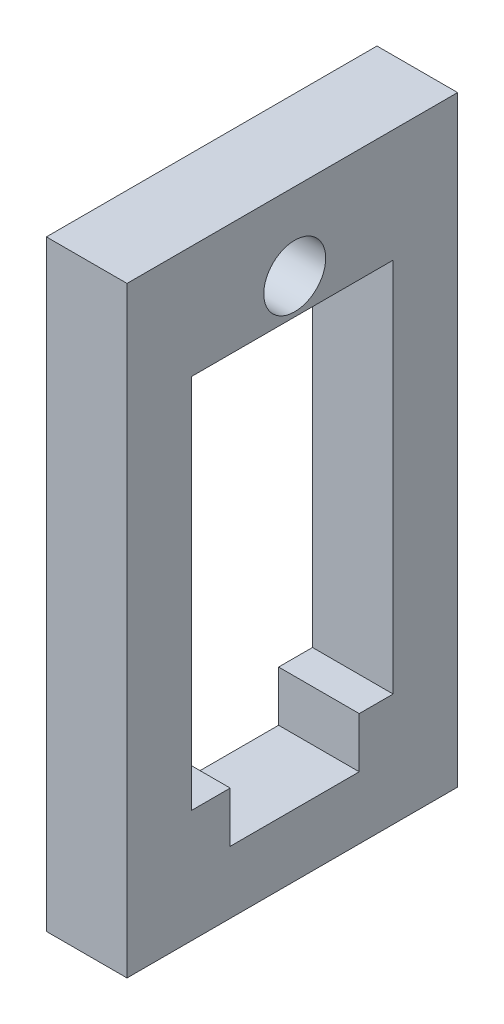
ISO-10303-21;
HEADER;
FILE_DESCRIPTION(('STEP AP214'),'2;1');
FILE_NAME('part.step','',(''),(''),'','','');
FILE_SCHEMA(('AUTOMOTIVE_DESIGN { 1 0 10303 214 1 1 1 1 }'));
ENDSEC;
DATA;
#1=APPLICATION_CONTEXT('core data for automotive mechanical design processes');
#2=APPLICATION_PROTOCOL_DEFINITION('international standard','automotive_design',2000,#1);
#3=PRODUCT_CONTEXT('',#1,'mechanical');
#4=PRODUCT('Part','Part','',(#3));
#5=PRODUCT_RELATED_PRODUCT_CATEGORY('part','',(#4));
#6=PRODUCT_DEFINITION_FORMATION('','',#4);
#7=PRODUCT_DEFINITION_CONTEXT('part definition',#1,'design');
#8=PRODUCT_DEFINITION('design','',#6,#7);
#9=PRODUCT_DEFINITION_SHAPE('','',#8);
#10=(LENGTH_UNIT() NAMED_UNIT(*) SI_UNIT(.MILLI.,.METRE.));
#11=(NAMED_UNIT(*) PLANE_ANGLE_UNIT() SI_UNIT($,.RADIAN.));
#12=(NAMED_UNIT(*) SI_UNIT($,.STERADIAN.) SOLID_ANGLE_UNIT());
#13=UNCERTAINTY_MEASURE_WITH_UNIT(LENGTH_MEASURE(1.E-05),#10,'distance_accuracy_value','');
#14=(GEOMETRIC_REPRESENTATION_CONTEXT(3) GLOBAL_UNCERTAINTY_ASSIGNED_CONTEXT((#13)) GLOBAL_UNIT_ASSIGNED_CONTEXT((#10,
#11,#12)) REPRESENTATION_CONTEXT('',''));
#15=CARTESIAN_POINT('',(0.,0.,0.));
#16=DIRECTION('',(0.,0.,1.));
#17=DIRECTION('',(1.,0.,0.));
#18=AXIS2_PLACEMENT_3D('',#15,#16,#17);
#19=CARTESIAN_POINT('',(5.,-12.05,6.4));
#20=DIRECTION('',(0.,1.,0.));
#21=DIRECTION('',(0.,0.,1.));
#22=AXIS2_PLACEMENT_3D('',#19,#20,#21);
#23=PLANE('',#22);
#24=DIRECTION('',(1.,0.,0.));
#25=VECTOR('',#24,1.);
#26=CARTESIAN_POINT('',(5.,-12.05,4.));
#27=LINE('',#26,#25);
#28=CARTESIAN_POINT('',(0.,-12.05,4.));
#29=VERTEX_POINT('',#28);
#30=CARTESIAN_POINT('',(5.,-12.05,4.));
#31=VERTEX_POINT('',#30);
#32=EDGE_CURVE('E44',#29,#31,#27,.T.);
#33=ORIENTED_EDGE('',*,*,#32,.F.);
#34=DIRECTION('',(0.,0.,-1.));
#35=VECTOR('',#34,1.);
#36=CARTESIAN_POINT('',(0.,-12.05,6.4));
#37=LINE('',#36,#35);
#38=CARTESIAN_POINT('',(0.,-12.05,6.4));
#39=VERTEX_POINT('',#38);
#40=EDGE_CURVE('E160',#39,#29,#37,.T.);
#41=ORIENTED_EDGE('',*,*,#40,.F.);
#42=DIRECTION('',(-1.,0.,0.));
#43=VECTOR('',#42,1.);
#44=CARTESIAN_POINT('',(5.,-12.05,6.4));
#45=LINE('',#44,#43);
#46=CARTESIAN_POINT('',(5.,-12.05,6.4));
#47=VERTEX_POINT('',#46);
#48=EDGE_CURVE('E59',#47,#39,#45,.T.);
#49=ORIENTED_EDGE('',*,*,#48,.F.);
#50=DIRECTION('',(0.,0.,-1.));
#51=VECTOR('',#50,1.);
#52=CARTESIAN_POINT('',(5.,-12.05,6.4));
#53=LINE('',#52,#51);
#54=EDGE_CURVE('E165',#47,#31,#53,.T.);
#55=ORIENTED_EDGE('',*,*,#54,.T.);
#56=EDGE_LOOP('',(#33,#41,#49,#55));
#57=FACE_BOUND('',#56,.T.);
#58=ADVANCED_FACE('F36',(#57),#23,.T.);
#59=CARTESIAN_POINT('',(5.,0.,0.));
#60=DIRECTION('',(-1.,0.,0.));
#61=DIRECTION('',(0.,0.,1.));
#62=AXIS2_PLACEMENT_3D('',#59,#60,#61);
#63=PLANE('',#62);
#64=CARTESIAN_POINT('',(5.,13.45,0.));
#65=DIRECTION('',(1.,0.,0.));
#66=DIRECTION('',(0.,0.,-1.));
#67=AXIS2_PLACEMENT_3D('',#64,#65,#66);
#68=CIRCLE('',#67,1.92);
#69=CARTESIAN_POINT('',(5.,13.45,-1.92));
#70=VERTEX_POINT('',#69);
#71=EDGE_CURVE('E153',#70,#70,#68,.T.);
#72=ORIENTED_EDGE('',*,*,#71,.F.);
#73=EDGE_LOOP('',(#72));
#74=FACE_BOUND('',#73,.T.);
#75=DIRECTION('',(0.,1.,0.));
#76=VECTOR('',#75,1.);
#77=CARTESIAN_POINT('',(5.,-19.05,-10.1));
#78=LINE('',#77,#76);
#79=CARTESIAN_POINT('',(5.,-19.05,-10.1));
#80=VERTEX_POINT('',#79);
#81=CARTESIAN_POINT('',(5.,18.25,-10.1));
#82=VERTEX_POINT('',#81);
#83=EDGE_CURVE('E189',#80,#82,#78,.T.);
#84=ORIENTED_EDGE('',*,*,#83,.T.);
#85=DIRECTION('',(0.,0.,1.));
#86=VECTOR('',#85,1.);
#87=CARTESIAN_POINT('',(5.,18.25,10.4));
#88=LINE('',#87,#86);
#89=CARTESIAN_POINT('',(5.,18.25,10.4));
#90=VERTEX_POINT('',#89);
#91=EDGE_CURVE('E192',#82,#90,#88,.T.);
#92=ORIENTED_EDGE('',*,*,#91,.T.);
#93=DIRECTION('',(0.,-1.,0.));
#94=VECTOR('',#93,1.);
#95=CARTESIAN_POINT('',(5.,-19.05,10.4));
#96=LINE('',#95,#94);
#97=CARTESIAN_POINT('',(5.,-19.05,10.4));
#98=VERTEX_POINT('',#97);
#99=EDGE_CURVE('E195',#90,#98,#96,.T.);
#100=ORIENTED_EDGE('',*,*,#99,.T.);
#101=DIRECTION('',(0.,0.,-1.));
#102=VECTOR('',#101,1.);
#103=CARTESIAN_POINT('',(5.,-19.05,10.4));
#104=LINE('',#103,#102);
#105=EDGE_CURVE('E197',#98,#80,#104,.T.);
#106=ORIENTED_EDGE('',*,*,#105,.T.);
#107=EDGE_LOOP('',(#84,#92,#100,#106));
#108=FACE_BOUND('',#107,.T.);
#109=DIRECTION('',(0.,0.,-1.));
#110=VECTOR('',#109,1.);
#111=CARTESIAN_POINT('',(5.,-15.1767991263553,4.));
#112=LINE('',#111,#110);
#113=CARTESIAN_POINT('',(5.,-15.1767991263553,4.));
#114=VERTEX_POINT('',#113);
#115=CARTESIAN_POINT('',(5.,-15.1767991263553,-4.));
#116=VERTEX_POINT('',#115);
#117=EDGE_CURVE('E130',#114,#116,#112,.T.);
#118=ORIENTED_EDGE('',*,*,#117,.F.);
#119=DIRECTION('',(0.,-1.,0.));
#120=VECTOR('',#119,1.);
#121=CARTESIAN_POINT('',(5.,-12.05,4.));
#122=LINE('',#121,#120);
#123=EDGE_CURVE('E137',#31,#114,#122,.T.);
#124=ORIENTED_EDGE('',*,*,#123,.F.);
#125=ORIENTED_EDGE('',*,*,#54,.F.);
#126=DIRECTION('',(0.,-1.,0.));
#127=VECTOR('',#126,1.);
#128=CARTESIAN_POINT('',(5.,-12.05,6.4));
#129=LINE('',#128,#127);
#130=CARTESIAN_POINT('',(5.,11.25,6.4));
#131=VERTEX_POINT('',#130);
#132=EDGE_CURVE('E162',#131,#47,#129,.T.);
#133=ORIENTED_EDGE('',*,*,#132,.F.);
#134=DIRECTION('',(0.,0.,1.));
#135=VECTOR('',#134,1.);
#136=CARTESIAN_POINT('',(5.,11.25,6.4));
#137=LINE('',#136,#135);
#138=CARTESIAN_POINT('',(5.,11.25,-6.1));
#139=VERTEX_POINT('',#138);
#140=EDGE_CURVE('E159',#139,#131,#137,.T.);
#141=ORIENTED_EDGE('',*,*,#140,.F.);
#142=DIRECTION('',(0.,1.,0.));
#143=VECTOR('',#142,1.);
#144=CARTESIAN_POINT('',(5.,-12.05,-6.1));
#145=LINE('',#144,#143);
#146=CARTESIAN_POINT('',(5.,-12.05,-6.1));
#147=VERTEX_POINT('',#146);
#148=EDGE_CURVE('E157',#147,#139,#145,.T.);
#149=ORIENTED_EDGE('',*,*,#148,.F.);
#150=CARTESIAN_POINT('',(5.,-12.05,-4.));
#151=VERTEX_POINT('',#150);
#152=EDGE_CURVE('E164',#151,#147,#53,.T.);
#153=ORIENTED_EDGE('',*,*,#152,.F.);
#154=DIRECTION('',(0.,1.,0.));
#155=VECTOR('',#154,1.);
#156=CARTESIAN_POINT('',(5.,-12.05,-4.));
#157=LINE('',#156,#155);
#158=EDGE_CURVE('E51',#116,#151,#157,.T.);
#159=ORIENTED_EDGE('',*,*,#158,.F.);
#160=EDGE_LOOP('',(#118,#124,#125,#133,#141,#149,#153,#159));
#161=FACE_BOUND('',#160,.T.);
#162=ADVANCED_FACE('F143',(#74,#108,#161),#63,.F.);
#163=CARTESIAN_POINT('',(0.,0.,0.));
#164=DIRECTION('',(-1.,0.,0.));
#165=DIRECTION('',(0.,0.,1.));
#166=AXIS2_PLACEMENT_3D('',#163,#164,#165);
#167=PLANE('',#166);
#168=DIRECTION('',(0.,1.,0.));
#169=VECTOR('',#168,1.);
#170=CARTESIAN_POINT('',(0.,0.,4.));
#171=LINE('',#170,#169);
#172=CARTESIAN_POINT('',(0.,-15.1767991263553,4.));
#173=VERTEX_POINT('',#172);
#174=EDGE_CURVE('E151',#173,#29,#171,.T.);
#175=ORIENTED_EDGE('',*,*,#174,.F.);
#176=DIRECTION('',(0.,0.,1.));
#177=VECTOR('',#176,1.);
#178=CARTESIAN_POINT('',(0.,-15.1767991263553,0.));
#179=LINE('',#178,#177);
#180=CARTESIAN_POINT('',(0.,-15.1767991263553,-4.));
#181=VERTEX_POINT('',#180);
#182=EDGE_CURVE('E11',#181,#173,#179,.T.);
#183=ORIENTED_EDGE('',*,*,#182,.F.);
#184=DIRECTION('',(0.,-1.,0.));
#185=VECTOR('',#184,1.);
#186=CARTESIAN_POINT('',(0.,0.,-4.));
#187=LINE('',#186,#185);
#188=CARTESIAN_POINT('',(0.,-12.05,-4.));
#189=VERTEX_POINT('',#188);
#190=EDGE_CURVE('E148',#189,#181,#187,.T.);
#191=ORIENTED_EDGE('',*,*,#190,.F.);
#192=CARTESIAN_POINT('',(0.,-12.05,-6.1));
#193=VERTEX_POINT('',#192);
#194=EDGE_CURVE('E177',#189,#193,#37,.T.);
#195=ORIENTED_EDGE('',*,*,#194,.T.);
#196=DIRECTION('',(0.,1.,0.));
#197=VECTOR('',#196,1.);
#198=CARTESIAN_POINT('',(0.,-12.05,-6.1));
#199=LINE('',#198,#197);
#200=CARTESIAN_POINT('',(0.,11.25,-6.1));
#201=VERTEX_POINT('',#200);
#202=EDGE_CURVE('E168',#193,#201,#199,.T.);
#203=ORIENTED_EDGE('',*,*,#202,.T.);
#204=DIRECTION('',(0.,0.,1.));
#205=VECTOR('',#204,1.);
#206=CARTESIAN_POINT('',(0.,11.25,6.4));
#207=LINE('',#206,#205);
#208=CARTESIAN_POINT('',(0.,11.25,6.4));
#209=VERTEX_POINT('',#208);
#210=EDGE_CURVE('E171',#201,#209,#207,.T.);
#211=ORIENTED_EDGE('',*,*,#210,.T.);
#212=DIRECTION('',(0.,-1.,0.));
#213=VECTOR('',#212,1.);
#214=CARTESIAN_POINT('',(0.,-12.05,6.4));
#215=LINE('',#214,#213);
#216=EDGE_CURVE('E174',#209,#39,#215,.T.);
#217=ORIENTED_EDGE('',*,*,#216,.T.);
#218=ORIENTED_EDGE('',*,*,#40,.T.);
#219=EDGE_LOOP('',(#175,#183,#191,#195,#203,#211,#217,#218));
#220=FACE_BOUND('',#219,.T.);
#221=CARTESIAN_POINT('',(0.,13.45,0.));
#222=DIRECTION('',(-1.,0.,0.));
#223=DIRECTION('',(0.,0.,1.));
#224=AXIS2_PLACEMENT_3D('',#221,#222,#223);
#225=CIRCLE('',#224,1.92);
#226=CARTESIAN_POINT('',(0.,13.45,1.92));
#227=VERTEX_POINT('',#226);
#228=EDGE_CURVE('E156',#227,#227,#225,.T.);
#229=ORIENTED_EDGE('',*,*,#228,.F.);
#230=EDGE_LOOP('',(#229));
#231=FACE_BOUND('',#230,.T.);
#232=DIRECTION('',(0.,1.,0.));
#233=VECTOR('',#232,1.);
#234=CARTESIAN_POINT('',(0.,-19.05,-10.1));
#235=LINE('',#234,#233);
#236=CARTESIAN_POINT('',(0.,-19.05,-10.1));
#237=VERTEX_POINT('',#236);
#238=CARTESIAN_POINT('',(0.,18.25,-10.1));
#239=VERTEX_POINT('',#238);
#240=EDGE_CURVE('E188',#237,#239,#235,.T.);
#241=ORIENTED_EDGE('',*,*,#240,.F.);
#242=DIRECTION('',(0.,0.,-1.));
#243=VECTOR('',#242,1.);
#244=CARTESIAN_POINT('',(0.,-19.05,10.4));
#245=LINE('',#244,#243);
#246=CARTESIAN_POINT('',(0.,-19.05,10.4));
#247=VERTEX_POINT('',#246);
#248=EDGE_CURVE('E193',#247,#237,#245,.T.);
#249=ORIENTED_EDGE('',*,*,#248,.F.);
#250=DIRECTION('',(0.,-1.,0.));
#251=VECTOR('',#250,1.);
#252=CARTESIAN_POINT('',(0.,-19.05,10.4));
#253=LINE('',#252,#251);
#254=CARTESIAN_POINT('',(0.,18.25,10.4));
#255=VERTEX_POINT('',#254);
#256=EDGE_CURVE('E204',#255,#247,#253,.T.);
#257=ORIENTED_EDGE('',*,*,#256,.F.);
#258=DIRECTION('',(0.,0.,1.));
#259=VECTOR('',#258,1.);
#260=CARTESIAN_POINT('',(0.,18.25,10.4));
#261=LINE('',#260,#259);
#262=EDGE_CURVE('E202',#239,#255,#261,.T.);
#263=ORIENTED_EDGE('',*,*,#262,.F.);
#264=EDGE_LOOP('',(#241,#249,#257,#263));
#265=FACE_BOUND('',#264,.T.);
#266=ADVANCED_FACE('F226',(#220,#231,#265),#167,.T.);
#267=CARTESIAN_POINT('',(5.,-19.05,-10.1));
#268=DIRECTION('',(0.,0.,1.));
#269=DIRECTION('',(1.,0.,0.));
#270=AXIS2_PLACEMENT_3D('',#267,#268,#269);
#271=PLANE('',#270);
#272=ORIENTED_EDGE('',*,*,#240,.T.);
#273=DIRECTION('',(-1.,0.,0.));
#274=VECTOR('',#273,1.);
#275=CARTESIAN_POINT('',(5.,18.25,-10.1));
#276=LINE('',#275,#274);
#277=EDGE_CURVE('E215',#82,#239,#276,.T.);
#278=ORIENTED_EDGE('',*,*,#277,.F.);
#279=ORIENTED_EDGE('',*,*,#83,.F.);
#280=DIRECTION('',(-1.,0.,0.));
#281=VECTOR('',#280,1.);
#282=CARTESIAN_POINT('',(5.,-19.05,-10.1));
#283=LINE('',#282,#281);
#284=EDGE_CURVE('E199',#80,#237,#283,.T.);
#285=ORIENTED_EDGE('',*,*,#284,.T.);
#286=EDGE_LOOP('',(#272,#278,#279,#285));
#287=FACE_BOUND('',#286,.T.);
#288=ADVANCED_FACE('F38',(#287),#271,.F.);
#289=CARTESIAN_POINT('',(5.,18.25,10.4));
#290=DIRECTION('',(0.,-1.,0.));
#291=DIRECTION('',(0.,0.,-1.));
#292=AXIS2_PLACEMENT_3D('',#289,#290,#291);
#293=PLANE('',#292);
#294=ORIENTED_EDGE('',*,*,#262,.T.);
#295=DIRECTION('',(-1.,0.,0.));
#296=VECTOR('',#295,1.);
#297=CARTESIAN_POINT('',(5.,18.25,10.4));
#298=LINE('',#297,#296);
#299=EDGE_CURVE('E212',#90,#255,#298,.T.);
#300=ORIENTED_EDGE('',*,*,#299,.F.);
#301=ORIENTED_EDGE('',*,*,#91,.F.);
#302=ORIENTED_EDGE('',*,*,#277,.T.);
#303=EDGE_LOOP('',(#294,#300,#301,#302));
#304=FACE_BOUND('',#303,.T.);
#305=ADVANCED_FACE('F274',(#304),#293,.F.);
#306=CARTESIAN_POINT('',(5.,-19.05,10.4));
#307=DIRECTION('',(0.,0.,-1.));
#308=DIRECTION('',(-1.,0.,0.));
#309=AXIS2_PLACEMENT_3D('',#306,#307,#308);
#310=PLANE('',#309);
#311=ORIENTED_EDGE('',*,*,#256,.T.);
#312=DIRECTION('',(-1.,0.,0.));
#313=VECTOR('',#312,1.);
#314=CARTESIAN_POINT('',(5.,-19.05,10.4));
#315=LINE('',#314,#313);
#316=EDGE_CURVE('E209',#98,#247,#315,.T.);
#317=ORIENTED_EDGE('',*,*,#316,.F.);
#318=ORIENTED_EDGE('',*,*,#99,.F.);
#319=ORIENTED_EDGE('',*,*,#299,.T.);
#320=EDGE_LOOP('',(#311,#317,#318,#319));
#321=FACE_BOUND('',#320,.T.);
#322=ADVANCED_FACE('F271',(#321),#310,.F.);
#323=CARTESIAN_POINT('',(5.,-19.05,10.4));
#324=DIRECTION('',(0.,1.,0.));
#325=DIRECTION('',(0.,0.,1.));
#326=AXIS2_PLACEMENT_3D('',#323,#324,#325);
#327=PLANE('',#326);
#328=ORIENTED_EDGE('',*,*,#248,.T.);
#329=ORIENTED_EDGE('',*,*,#284,.F.);
#330=ORIENTED_EDGE('',*,*,#105,.F.);
#331=ORIENTED_EDGE('',*,*,#316,.T.);
#332=EDGE_LOOP('',(#328,#329,#330,#331));
#333=FACE_BOUND('',#332,.T.);
#334=ADVANCED_FACE('F265',(#333),#327,.F.);
#335=CARTESIAN_POINT('',(5.,-12.05,-6.1));
#336=DIRECTION('',(0.,0.,1.));
#337=DIRECTION('',(1.,0.,0.));
#338=AXIS2_PLACEMENT_3D('',#335,#336,#337);
#339=PLANE('',#338);
#340=ORIENTED_EDGE('',*,*,#202,.F.);
#341=DIRECTION('',(-1.,0.,0.));
#342=VECTOR('',#341,1.);
#343=CARTESIAN_POINT('',(5.,-12.05,-6.1));
#344=LINE('',#343,#342);
#345=EDGE_CURVE('E167',#147,#193,#344,.T.);
#346=ORIENTED_EDGE('',*,*,#345,.F.);
#347=ORIENTED_EDGE('',*,*,#148,.T.);
#348=DIRECTION('',(-1.,0.,0.));
#349=VECTOR('',#348,1.);
#350=CARTESIAN_POINT('',(5.,11.25,-6.1));
#351=LINE('',#350,#349);
#352=EDGE_CURVE('E185',#139,#201,#351,.T.);
#353=ORIENTED_EDGE('',*,*,#352,.T.);
#354=EDGE_LOOP('',(#340,#346,#347,#353));
#355=FACE_BOUND('',#354,.T.);
#356=ADVANCED_FACE('F233',(#355),#339,.T.);
#357=CARTESIAN_POINT('',(5.,11.25,6.4));
#358=DIRECTION('',(0.,-1.,0.));
#359=DIRECTION('',(0.,0.,-1.));
#360=AXIS2_PLACEMENT_3D('',#357,#358,#359);
#361=PLANE('',#360);
#362=ORIENTED_EDGE('',*,*,#210,.F.);
#363=ORIENTED_EDGE('',*,*,#352,.F.);
#364=ORIENTED_EDGE('',*,*,#140,.T.);
#365=DIRECTION('',(-1.,0.,0.));
#366=VECTOR('',#365,1.);
#367=CARTESIAN_POINT('',(5.,11.25,6.4));
#368=LINE('',#367,#366);
#369=EDGE_CURVE('E183',#131,#209,#368,.T.);
#370=ORIENTED_EDGE('',*,*,#369,.T.);
#371=EDGE_LOOP('',(#362,#363,#364,#370));
#372=FACE_BOUND('',#371,.T.);
#373=ADVANCED_FACE('F239',(#372),#361,.T.);
#374=CARTESIAN_POINT('',(5.,-12.05,6.4));
#375=DIRECTION('',(0.,0.,-1.));
#376=DIRECTION('',(-1.,0.,0.));
#377=AXIS2_PLACEMENT_3D('',#374,#375,#376);
#378=PLANE('',#377);
#379=ORIENTED_EDGE('',*,*,#216,.F.);
#380=ORIENTED_EDGE('',*,*,#369,.F.);
#381=ORIENTED_EDGE('',*,*,#132,.T.);
#382=ORIENTED_EDGE('',*,*,#48,.T.);
#383=EDGE_LOOP('',(#379,#380,#381,#382));
#384=FACE_BOUND('',#383,.T.);
#385=ADVANCED_FACE('F242',(#384),#378,.T.);
#386=DIRECTION('',(-1.,0.,0.));
#387=VECTOR('',#386,1.);
#388=CARTESIAN_POINT('',(5.,-12.05,-4.));
#389=LINE('',#388,#387);
#390=EDGE_CURVE('E218',#151,#189,#389,.T.);
#391=ORIENTED_EDGE('',*,*,#390,.F.);
#392=ORIENTED_EDGE('',*,*,#152,.T.);
#393=ORIENTED_EDGE('',*,*,#345,.T.);
#394=ORIENTED_EDGE('',*,*,#194,.F.);
#395=EDGE_LOOP('',(#391,#392,#393,#394));
#396=FACE_BOUND('',#395,.T.);
#397=ADVANCED_FACE('F229',(#396),#23,.T.);
#398=CARTESIAN_POINT('',(-8.,13.45,0.));
#399=DIRECTION('',(1.,0.,0.));
#400=DIRECTION('',(0.,0.,-1.));
#401=AXIS2_PLACEMENT_3D('',#398,#399,#400);
#402=CYLINDRICAL_SURFACE('',#401,1.92);
#403=ORIENTED_EDGE('',*,*,#228,.T.);
#404=EDGE_LOOP('',(#403));
#405=FACE_BOUND('',#404,.T.);
#406=ORIENTED_EDGE('',*,*,#71,.T.);
#407=EDGE_LOOP('',(#406));
#408=FACE_BOUND('',#407,.T.);
#409=ADVANCED_FACE('F253',(#405,#408),#402,.F.);
#410=CARTESIAN_POINT('',(-15.,-12.05,4.));
#411=DIRECTION('',(0.,0.,1.));
#412=DIRECTION('',(0.,-1.,0.));
#413=AXIS2_PLACEMENT_3D('',#410,#411,#412);
#414=PLANE('',#413);
#415=ORIENTED_EDGE('',*,*,#174,.T.);
#416=ORIENTED_EDGE('',*,*,#32,.T.);
#417=ORIENTED_EDGE('',*,*,#123,.T.);
#418=DIRECTION('',(1.,0.,0.));
#419=VECTOR('',#418,1.);
#420=CARTESIAN_POINT('',(-15.,-15.1767991263553,4.));
#421=LINE('',#420,#419);
#422=EDGE_CURVE('E125',#173,#114,#421,.T.);
#423=ORIENTED_EDGE('',*,*,#422,.F.);
#424=EDGE_LOOP('',(#415,#416,#417,#423));
#425=FACE_BOUND('',#424,.T.);
#426=ADVANCED_FACE('F138',(#425),#414,.F.);
#427=CARTESIAN_POINT('',(-15.,-12.05,-4.));
#428=DIRECTION('',(0.,0.,-1.));
#429=DIRECTION('',(0.,1.,0.));
#430=AXIS2_PLACEMENT_3D('',#427,#428,#429);
#431=PLANE('',#430);
#432=ORIENTED_EDGE('',*,*,#190,.T.);
#433=DIRECTION('',(1.,0.,0.));
#434=VECTOR('',#433,1.);
#435=CARTESIAN_POINT('',(-15.,-15.1767991263553,-4.));
#436=LINE('',#435,#434);
#437=EDGE_CURVE('E134',#181,#116,#436,.T.);
#438=ORIENTED_EDGE('',*,*,#437,.T.);
#439=ORIENTED_EDGE('',*,*,#158,.T.);
#440=ORIENTED_EDGE('',*,*,#390,.T.);
#441=EDGE_LOOP('',(#432,#438,#439,#440));
#442=FACE_BOUND('',#441,.T.);
#443=ADVANCED_FACE('F222',(#442),#431,.F.);
#444=CARTESIAN_POINT('',(-15.,-15.1767991263553,4.));
#445=DIRECTION('',(0.,-1.,0.));
#446=DIRECTION('',(0.,0.,-1.));
#447=AXIS2_PLACEMENT_3D('',#444,#445,#446);
#448=PLANE('',#447);
#449=ORIENTED_EDGE('',*,*,#182,.T.);
#450=ORIENTED_EDGE('',*,*,#422,.T.);
#451=ORIENTED_EDGE('',*,*,#117,.T.);
#452=ORIENTED_EDGE('',*,*,#437,.F.);
#453=EDGE_LOOP('',(#449,#450,#451,#452));
#454=FACE_BOUND('',#453,.T.);
#455=ADVANCED_FACE('F127',(#454),#448,.F.);
#456=CLOSED_SHELL('',(#58,#162,#266,#288,#305,#322,#334,#356,#373,#385,#397,#409,#426,#443,#455));
#457=MANIFOLD_SOLID_BREP('B2',#456);
#458=ADVANCED_BREP_SHAPE_REPRESENTATION('',(#18,#457),#14);
#459=SHAPE_DEFINITION_REPRESENTATION(#9,#458);
ENDSEC;
END-ISO-10303-21;
